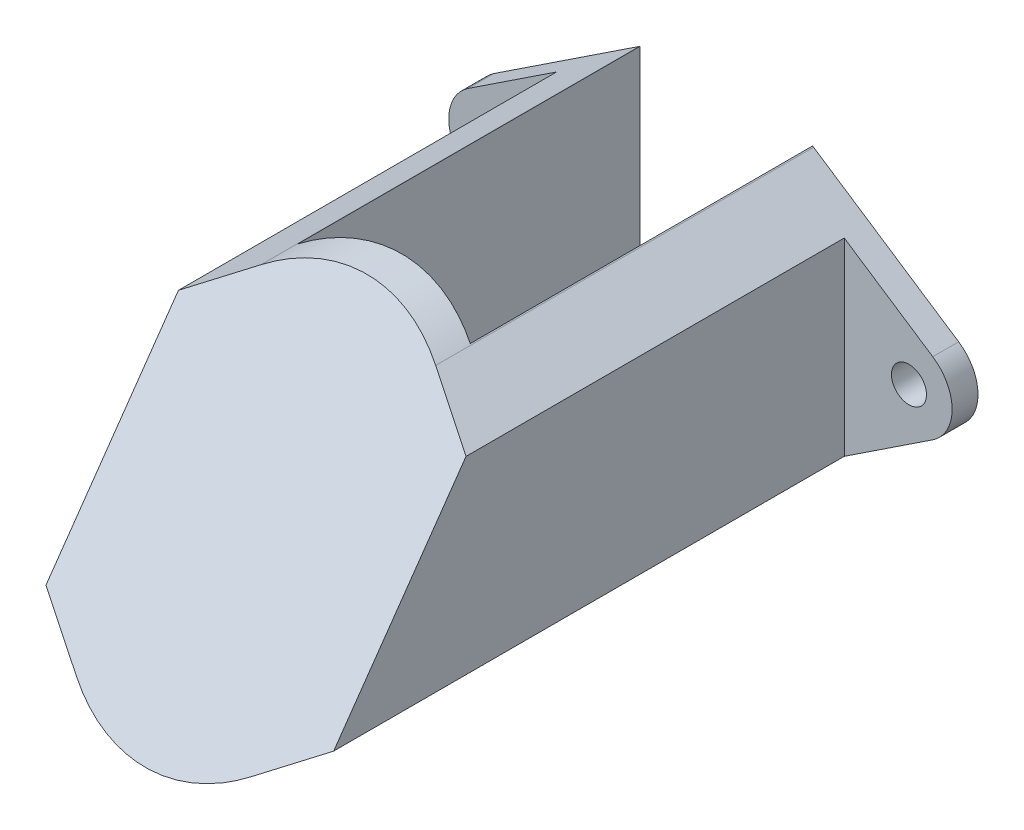
ISO-10303-21;
HEADER;
FILE_DESCRIPTION(('STEP AP214'),'2;1');
FILE_NAME('part.step','',(''),(''),'','','');
FILE_SCHEMA(('AUTOMOTIVE_DESIGN { 1 0 10303 214 1 1 1 1 }'));
ENDSEC;
DATA;
#1=APPLICATION_CONTEXT('core data for automotive mechanical design processes');
#2=APPLICATION_PROTOCOL_DEFINITION('international standard','automotive_design',2000,#1);
#3=PRODUCT_CONTEXT('',#1,'mechanical');
#4=PRODUCT('Part','Part','',(#3));
#5=PRODUCT_RELATED_PRODUCT_CATEGORY('part','',(#4));
#6=PRODUCT_DEFINITION_FORMATION('','',#4);
#7=PRODUCT_DEFINITION_CONTEXT('part definition',#1,'design');
#8=PRODUCT_DEFINITION('design','',#6,#7);
#9=PRODUCT_DEFINITION_SHAPE('','',#8);
#10=(LENGTH_UNIT() NAMED_UNIT(*) SI_UNIT(.MILLI.,.METRE.));
#11=(NAMED_UNIT(*) PLANE_ANGLE_UNIT() SI_UNIT($,.RADIAN.));
#12=(NAMED_UNIT(*) SI_UNIT($,.STERADIAN.) SOLID_ANGLE_UNIT());
#13=UNCERTAINTY_MEASURE_WITH_UNIT(LENGTH_MEASURE(1.E-05),#10,'distance_accuracy_value','');
#14=(GEOMETRIC_REPRESENTATION_CONTEXT(3) GLOBAL_UNCERTAINTY_ASSIGNED_CONTEXT((#13)) GLOBAL_UNIT_ASSIGNED_CONTEXT((#10,
#11,#12)) REPRESENTATION_CONTEXT('',''));
#15=CARTESIAN_POINT('',(0.,0.,0.));
#16=DIRECTION('',(0.,0.,1.));
#17=DIRECTION('',(1.,0.,0.));
#18=AXIS2_PLACEMENT_3D('',#15,#16,#17);
#19=CARTESIAN_POINT('',(-14.5,0.,0.));
#20=DIRECTION('',(0.,0.,1.));
#21=DIRECTION('',(1.,0.,0.));
#22=AXIS2_PLACEMENT_3D('',#19,#20,#21);
#23=PLANE('',#22);
#24=CARTESIAN_POINT('',(-14.5,0.,0.));
#25=DIRECTION('',(0.,0.,1.));
#26=DIRECTION('',(1.,0.,0.));
#27=AXIS2_PLACEMENT_3D('',#24,#25,#26);
#28=CIRCLE('',#27,1.2192);
#29=CARTESIAN_POINT('',(-13.2808,0.,0.));
#30=VERTEX_POINT('',#29);
#31=EDGE_CURVE('E183',#30,#30,#28,.T.);
#32=ORIENTED_EDGE('',*,*,#31,.T.);
#33=EDGE_LOOP('',(#32));
#34=FACE_BOUND('',#33,.T.);
#35=CARTESIAN_POINT('',(0.,0.,0.));
#36=DIRECTION('',(0.,0.,1.));
#37=DIRECTION('',(1.,0.,0.));
#38=AXIS2_PLACEMENT_3D('',#35,#36,#37);
#39=CIRCLE('',#38,11.);
#40=CARTESIAN_POINT('',(-6.00000000000001,9.21954445729288,0.));
#41=VERTEX_POINT('',#40);
#42=CARTESIAN_POINT('',(-6.06896551724138,9.174293299788,0.));
#43=VERTEX_POINT('',#42);
#44=EDGE_CURVE('E243',#41,#43,#39,.T.);
#45=ORIENTED_EDGE('',*,*,#44,.F.);
#46=DIRECTION('',(0.,-1.,0.));
#47=VECTOR('',#46,1.);
#48=CARTESIAN_POINT('',(-6.00000000000001,0.,0.));
#49=LINE('',#48,#47);
#50=CARTESIAN_POINT('',(-6.00000000000001,-9.21954445729288,0.));
#51=VERTEX_POINT('',#50);
#52=EDGE_CURVE('E44',#41,#51,#49,.T.);
#53=ORIENTED_EDGE('',*,*,#52,.T.);
#54=CARTESIAN_POINT('',(0.,0.,0.));
#55=DIRECTION('',(0.,0.,1.));
#56=DIRECTION('',(1.,0.,0.));
#57=AXIS2_PLACEMENT_3D('',#54,#55,#56);
#58=CIRCLE('',#57,11.);
#59=CARTESIAN_POINT('',(-6.06896551724137,-9.174293299788,0.));
#60=VERTEX_POINT('',#59);
#61=EDGE_CURVE('E232',#60,#51,#58,.T.);
#62=ORIENTED_EDGE('',*,*,#61,.F.);
#63=DIRECTION('',(0.834026663617092,-0.551724137931034,0.));
#64=VECTOR('',#63,1.);
#65=CARTESIAN_POINT('',(-6.06896551724137,-9.174293299788,0.));
#66=LINE('',#65,#64);
#67=CARTESIAN_POINT('',(-16.1551724137931,-2.50207999085127,0.));
#68=VERTEX_POINT('',#67);
#69=EDGE_CURVE('E228',#68,#60,#66,.T.);
#70=ORIENTED_EDGE('',*,*,#69,.F.);
#71=CARTESIAN_POINT('',(-14.5,0.,0.));
#72=DIRECTION('',(0.,0.,1.));
#73=DIRECTION('',(1.,0.,0.));
#74=AXIS2_PLACEMENT_3D('',#71,#72,#73);
#75=CIRCLE('',#74,3.);
#76=CARTESIAN_POINT('',(-16.1551724137931,2.50207999085127,0.));
#77=VERTEX_POINT('',#76);
#78=EDGE_CURVE('E225',#77,#68,#75,.T.);
#79=ORIENTED_EDGE('',*,*,#78,.F.);
#80=DIRECTION('',(-0.834026663617092,-0.551724137931034,0.));
#81=VECTOR('',#80,1.);
#82=CARTESIAN_POINT('',(-16.1551724137931,2.50207999085127,0.));
#83=LINE('',#82,#81);
#84=EDGE_CURVE('E247',#43,#77,#83,.T.);
#85=ORIENTED_EDGE('',*,*,#84,.F.);
#86=EDGE_LOOP('',(#45,#53,#62,#70,#79,#85));
#87=FACE_BOUND('',#86,.T.);
#88=ADVANCED_FACE('F36',(#34,#87),#23,.F.);
#89=CARTESIAN_POINT('',(-17.5,11.,25.));
#90=DIRECTION('',(0.,0.573576436351041,0.819152044288995));
#91=DIRECTION('',(0.,-0.819152044288995,0.573576436351041));
#92=AXIS2_PLACEMENT_3D('',#89,#90,#91);
#93=PLANE('',#92);
#94=DIRECTION('',(-0.777989561921298,-0.514654553739108,0.360364998102073));
#95=VECTOR('',#94,1.);
#96=CARTESIAN_POINT('',(-20.0941470695361,-0.10362494770183,32.7748418898341));
#97=LINE('',#96,#95);
#98=CARTESIAN_POINT('',(-6.06896551724137,9.174293299788,26.2783735940484));
#99=VERTEX_POINT('',#98);
#100=CARTESIAN_POINT('',(-10.,6.57384093322804,28.099229943869));
#101=VERTEX_POINT('',#100);
#102=EDGE_CURVE('E268',#99,#101,#97,.T.);
#103=ORIENTED_EDGE('',*,*,#102,.T.);
#104=DIRECTION('',(0.,-0.819152044288995,0.573576436351041));
#105=VECTOR('',#104,1.);
#106=CARTESIAN_POINT('',(-10.,11.,25.));
#107=LINE('',#106,#105);
#108=CARTESIAN_POINT('',(-10.,-6.57384093322804,37.3053358967445));
#109=VERTEX_POINT('',#108);
#110=EDGE_CURVE('E274',#101,#109,#107,.T.);
#111=ORIENTED_EDGE('',*,*,#110,.T.);
#112=DIRECTION('',(0.777989561921298,-0.514654553739107,0.360364998102073));
#113=VECTOR('',#112,1.);
#114=CARTESIAN_POINT('',(-4.4221835595796,-10.2636701693607,39.8889821425911));
#115=LINE('',#114,#113);
#116=CARTESIAN_POINT('',(-6.06896551724137,-9.174293299788,39.126192246565));
#117=VERTEX_POINT('',#116);
#118=EDGE_CURVE('E218',#109,#117,#115,.T.);
#119=ORIENTED_EDGE('',*,*,#118,.T.);
#120=CARTESIAN_POINT('',(0.,0.,32.7022829203067));
#121=DIRECTION('',(0.,0.573576436351041,0.819152044288995));
#122=DIRECTION('',(0.,0.819152044288995,-0.573576436351041));
#123=AXIS2_PLACEMENT_3D('',#120,#121,#122);
#124=ELLIPSE('',#123,13.428520476376,11.);
#125=CARTESIAN_POINT('',(6.06896551724138,-9.174293299788,39.126192246565));
#126=VERTEX_POINT('',#125);
#127=EDGE_CURVE('E223',#117,#126,#124,.T.);
#128=ORIENTED_EDGE('',*,*,#127,.T.);
#129=DIRECTION('',(0.777989561921297,0.514654553739108,-0.360364998102073));
#130=VECTOR('',#129,1.);
#131=CARTESIAN_POINT('',(13.1985660572277,-4.45793004269847,35.8237591410157));
#132=LINE('',#131,#130);
#133=CARTESIAN_POINT('',(9.99999999999999,-6.57384093322805,37.3053358967445));
#134=VERTEX_POINT('',#133);
#135=EDGE_CURVE('E220',#126,#134,#132,.T.);
#136=ORIENTED_EDGE('',*,*,#135,.T.);
#137=DIRECTION('',(0.,0.819152044288995,-0.573576436351041));
#138=VECTOR('',#137,1.);
#139=CARTESIAN_POINT('',(9.99999999999999,11.,25.));
#140=LINE('',#139,#138);
#141=CARTESIAN_POINT('',(9.99999999999999,6.57384093322805,28.099229943869));
#142=VERTEX_POINT('',#141);
#143=EDGE_CURVE('E271',#134,#142,#140,.T.);
#144=ORIENTED_EDGE('',*,*,#143,.T.);
#145=DIRECTION('',(-0.777989561921298,0.514654553739107,-0.360364998102073));
#146=VECTOR('',#145,1.);
#147=CARTESIAN_POINT('',(11.317764571888,5.70211517896037,28.7096188882587));
#148=LINE('',#147,#146);
#149=CARTESIAN_POINT('',(6.06896551724137,9.174293299788,26.2783735940484));
#150=VERTEX_POINT('',#149);
#151=EDGE_CURVE('E216',#142,#150,#148,.T.);
#152=ORIENTED_EDGE('',*,*,#151,.T.);
#153=CARTESIAN_POINT('',(0.,0.,32.7022829203067));
#154=DIRECTION('',(0.,0.573576436351041,0.819152044288995));
#155=DIRECTION('',(0.,0.819152044288995,-0.573576436351041));
#156=AXIS2_PLACEMENT_3D('',#153,#154,#155);
#157=ELLIPSE('',#156,13.428520476376,11.);
#158=EDGE_CURVE('E214',#150,#99,#157,.T.);
#159=ORIENTED_EDGE('',*,*,#158,.T.);
#160=EDGE_LOOP('',(#103,#111,#119,#128,#136,#144,#152,#159));
#161=FACE_BOUND('',#160,.T.);
#162=ADVANCED_FACE('F320',(#161),#93,.T.);
#163=CARTESIAN_POINT('',(-14.5,0.,45.));
#164=DIRECTION('',(0.,0.,-1.));
#165=DIRECTION('',(-1.,0.,0.));
#166=AXIS2_PLACEMENT_3D('',#163,#164,#165);
#167=CYLINDRICAL_SURFACE('',#166,3.);
#168=DIRECTION('',(0.,0.,-1.));
#169=VECTOR('',#168,1.);
#170=CARTESIAN_POINT('',(-16.1551724137931,-2.50207999085127,45.));
#171=LINE('',#170,#169);
#172=CARTESIAN_POINT('',(-16.1551724137931,-2.50207999085128,1.8));
#173=VERTEX_POINT('',#172);
#174=EDGE_CURVE('E266',#173,#68,#171,.T.);
#175=ORIENTED_EDGE('',*,*,#174,.F.);
#176=CARTESIAN_POINT('',(-14.5,0.,1.8));
#177=DIRECTION('',(0.,0.,-1.));
#178=DIRECTION('',(-1.,0.,0.));
#179=AXIS2_PLACEMENT_3D('',#176,#177,#178);
#180=CIRCLE('',#179,3.);
#181=CARTESIAN_POINT('',(-16.1551724137931,2.50207999085127,1.8));
#182=VERTEX_POINT('',#181);
#183=EDGE_CURVE('E199',#173,#182,#180,.T.);
#184=ORIENTED_EDGE('',*,*,#183,.T.);
#185=DIRECTION('',(0.,0.,-1.));
#186=VECTOR('',#185,1.);
#187=CARTESIAN_POINT('',(-16.1551724137931,2.50207999085127,45.));
#188=LINE('',#187,#186);
#189=EDGE_CURVE('E250',#182,#77,#188,.T.);
#190=ORIENTED_EDGE('',*,*,#189,.T.);
#191=ORIENTED_EDGE('',*,*,#78,.T.);
#192=EDGE_LOOP('',(#175,#184,#190,#191));
#193=FACE_BOUND('',#192,.T.);
#194=ADVANCED_FACE('F38',(#193),#167,.T.);
#195=CARTESIAN_POINT('',(-6.06896551724137,-9.174293299788,45.));
#196=DIRECTION('',(0.551724137931034,0.834026663617092,0.));
#197=DIRECTION('',(-0.834026663617092,0.551724137931034,0.));
#198=AXIS2_PLACEMENT_3D('',#195,#196,#197);
#199=PLANE('',#198);
#200=DIRECTION('',(0.,0.,1.));
#201=VECTOR('',#200,1.);
#202=CARTESIAN_POINT('',(-10.,-6.57384093322804,45.));
#203=LINE('',#202,#201);
#204=CARTESIAN_POINT('',(-10.,-6.57384093322804,1.8));
#205=VERTEX_POINT('',#204);
#206=EDGE_CURVE('E59',#205,#109,#203,.T.);
#207=ORIENTED_EDGE('',*,*,#206,.F.);
#208=DIRECTION('',(-0.834026663617092,0.551724137931034,0.));
#209=VECTOR('',#208,1.);
#210=CARTESIAN_POINT('',(-6.06896551724137,-9.174293299788,1.8));
#211=LINE('',#210,#209);
#212=EDGE_CURVE('E202',#205,#173,#211,.T.);
#213=ORIENTED_EDGE('',*,*,#212,.T.);
#214=ORIENTED_EDGE('',*,*,#174,.T.);
#215=ORIENTED_EDGE('',*,*,#69,.T.);
#216=DIRECTION('',(0.,0.,-1.));
#217=VECTOR('',#216,1.);
#218=CARTESIAN_POINT('',(-6.06896551724137,-9.174293299788,45.));
#219=LINE('',#218,#217);
#220=EDGE_CURVE('E264',#117,#60,#219,.T.);
#221=ORIENTED_EDGE('',*,*,#220,.F.);
#222=ORIENTED_EDGE('',*,*,#118,.F.);
#223=EDGE_LOOP('',(#207,#213,#214,#215,#221,#222));
#224=FACE_BOUND('',#223,.T.);
#225=ADVANCED_FACE('F292',(#224),#199,.F.);
#226=CARTESIAN_POINT('',(0.,0.,45.));
#227=DIRECTION('',(0.,0.,-1.));
#228=DIRECTION('',(-1.,0.,0.));
#229=AXIS2_PLACEMENT_3D('',#226,#227,#228);
#230=CYLINDRICAL_SURFACE('',#229,11.);
#231=ORIENTED_EDGE('',*,*,#61,.T.);
#232=DIRECTION('',(0.,0.,-1.));
#233=VECTOR('',#232,1.);
#234=CARTESIAN_POINT('',(-6.00000000000001,-9.21954445729288,45.));
#235=LINE('',#234,#233);
#236=CARTESIAN_POINT('',(-6.00000000000001,-9.21954445729285,36.7163282706398));
#237=VERTEX_POINT('',#236);
#238=EDGE_CURVE('E169',#51,#237,#235,.F.);
#239=ORIENTED_EDGE('',*,*,#238,.T.);
#240=CARTESIAN_POINT('',(0.,0.,30.2607337427839));
#241=DIRECTION('',(0.,-0.573576436351041,-0.819152044288995));
#242=DIRECTION('',(0.,0.819152044288995,-0.573576436351041));
#243=AXIS2_PLACEMENT_3D('',#240,#241,#242);
#244=ELLIPSE('',#243,13.428520476376,11.);
#245=CARTESIAN_POINT('',(6.00000000000001,-9.21954445729285,36.7163282706398));
#246=VERTEX_POINT('',#245);
#247=EDGE_CURVE('E161',#246,#237,#244,.T.);
#248=ORIENTED_EDGE('',*,*,#247,.F.);
#249=DIRECTION('',(0.,0.,-1.));
#250=VECTOR('',#249,1.);
#251=CARTESIAN_POINT('',(6.00000000000001,-9.21954445729287,45.));
#252=LINE('',#251,#250);
#253=CARTESIAN_POINT('',(6.00000000000001,-9.21954445729288,0.));
#254=VERTEX_POINT('',#253);
#255=EDGE_CURVE('E148',#246,#254,#252,.T.);
#256=ORIENTED_EDGE('',*,*,#255,.T.);
#257=CARTESIAN_POINT('',(6.06896551724138,-9.174293299788,0.));
#258=VERTEX_POINT('',#257);
#259=EDGE_CURVE('E231',#254,#258,#58,.T.);
#260=ORIENTED_EDGE('',*,*,#259,.T.);
#261=DIRECTION('',(0.,0.,-1.));
#262=VECTOR('',#261,1.);
#263=CARTESIAN_POINT('',(6.06896551724138,-9.174293299788,45.));
#264=LINE('',#263,#262);
#265=EDGE_CURVE('E261',#126,#258,#264,.T.);
#266=ORIENTED_EDGE('',*,*,#265,.F.);
#267=ORIENTED_EDGE('',*,*,#127,.F.);
#268=ORIENTED_EDGE('',*,*,#220,.T.);
#269=EDGE_LOOP('',(#231,#239,#248,#256,#260,#266,#267,#268));
#270=FACE_BOUND('',#269,.T.);
#271=ADVANCED_FACE('F168',(#270),#230,.T.);
#272=CARTESIAN_POINT('',(16.1551724137931,-2.50207999085127,45.));
#273=DIRECTION('',(-0.551724137931035,0.834026663617091,0.));
#274=DIRECTION('',(-0.834026663617091,-0.551724137931035,0.));
#275=AXIS2_PLACEMENT_3D('',#272,#273,#274);
#276=PLANE('',#275);
#277=DIRECTION('',(0.,0.,-1.));
#278=VECTOR('',#277,1.);
#279=CARTESIAN_POINT('',(16.1551724137931,-2.50207999085127,45.));
#280=LINE('',#279,#278);
#281=CARTESIAN_POINT('',(16.1551724137931,-2.50207999085127,1.8));
#282=VERTEX_POINT('',#281);
#283=CARTESIAN_POINT('',(16.1551724137931,-2.50207999085127,0.));
#284=VERTEX_POINT('',#283);
#285=EDGE_CURVE('E259',#282,#284,#280,.T.);
#286=ORIENTED_EDGE('',*,*,#285,.F.);
#287=DIRECTION('',(-0.834026663617091,-0.551724137931035,0.));
#288=VECTOR('',#287,1.);
#289=CARTESIAN_POINT('',(16.1551724137931,-2.50207999085127,1.8));
#290=LINE('',#289,#288);
#291=CARTESIAN_POINT('',(10.,-6.57384093322805,1.8));
#292=VERTEX_POINT('',#291);
#293=EDGE_CURVE('E211',#282,#292,#290,.T.);
#294=ORIENTED_EDGE('',*,*,#293,.T.);
#295=DIRECTION('',(0.,0.,-1.));
#296=VECTOR('',#295,1.);
#297=CARTESIAN_POINT('',(10.,-6.57384093322805,45.));
#298=LINE('',#297,#296);
#299=EDGE_CURVE('E194',#134,#292,#298,.T.);
#300=ORIENTED_EDGE('',*,*,#299,.F.);
#301=ORIENTED_EDGE('',*,*,#135,.F.);
#302=ORIENTED_EDGE('',*,*,#265,.T.);
#303=DIRECTION('',(0.834026663617091,0.551724137931035,0.));
#304=VECTOR('',#303,1.);
#305=CARTESIAN_POINT('',(16.1551724137931,-2.50207999085127,0.));
#306=LINE('',#305,#304);
#307=EDGE_CURVE('E234',#258,#284,#306,.T.);
#308=ORIENTED_EDGE('',*,*,#307,.T.);
#309=EDGE_LOOP('',(#286,#294,#300,#301,#302,#308));
#310=FACE_BOUND('',#309,.T.);
#311=ADVANCED_FACE('F348',(#310),#276,.F.);
#312=CARTESIAN_POINT('',(14.5,0.,45.));
#313=DIRECTION('',(0.,0.,-1.));
#314=DIRECTION('',(-1.,0.,0.));
#315=AXIS2_PLACEMENT_3D('',#312,#313,#314);
#316=CYLINDRICAL_SURFACE('',#315,3.);
#317=DIRECTION('',(0.,0.,-1.));
#318=VECTOR('',#317,1.);
#319=CARTESIAN_POINT('',(16.1551724137931,2.50207999085128,45.));
#320=LINE('',#319,#318);
#321=CARTESIAN_POINT('',(16.1551724137931,2.50207999085128,1.8));
#322=VERTEX_POINT('',#321);
#323=CARTESIAN_POINT('',(16.1551724137931,2.50207999085128,0.));
#324=VERTEX_POINT('',#323);
#325=EDGE_CURVE('E257',#322,#324,#320,.T.);
#326=ORIENTED_EDGE('',*,*,#325,.F.);
#327=CARTESIAN_POINT('',(14.5,0.,1.8));
#328=DIRECTION('',(0.,0.,-1.));
#329=DIRECTION('',(-1.,0.,0.));
#330=AXIS2_PLACEMENT_3D('',#327,#328,#329);
#331=CIRCLE('',#330,3.);
#332=EDGE_CURVE('E208',#322,#282,#331,.T.);
#333=ORIENTED_EDGE('',*,*,#332,.T.);
#334=ORIENTED_EDGE('',*,*,#285,.T.);
#335=CARTESIAN_POINT('',(14.5,0.,0.));
#336=DIRECTION('',(0.,0.,1.));
#337=DIRECTION('',(1.,0.,0.));
#338=AXIS2_PLACEMENT_3D('',#335,#336,#337);
#339=CIRCLE('',#338,3.);
#340=EDGE_CURVE('E237',#284,#324,#339,.T.);
#341=ORIENTED_EDGE('',*,*,#340,.T.);
#342=EDGE_LOOP('',(#326,#333,#334,#341));
#343=FACE_BOUND('',#342,.T.);
#344=ADVANCED_FACE('F360',(#343),#316,.T.);
#345=CARTESIAN_POINT('',(6.06896551724137,9.174293299788,45.));
#346=DIRECTION('',(-0.551724137931033,-0.834026663617092,0.));
#347=DIRECTION('',(0.834026663617092,-0.551724137931034,0.));
#348=AXIS2_PLACEMENT_3D('',#345,#346,#347);
#349=PLANE('',#348);
#350=DIRECTION('',(0.,0.,1.));
#351=VECTOR('',#350,1.);
#352=CARTESIAN_POINT('',(10.,6.57384093322805,45.));
#353=LINE('',#352,#351);
#354=CARTESIAN_POINT('',(10.,6.57384093322805,1.8));
#355=VERTEX_POINT('',#354);
#356=EDGE_CURVE('E192',#355,#142,#353,.T.);
#357=ORIENTED_EDGE('',*,*,#356,.F.);
#358=DIRECTION('',(0.834026663617092,-0.551724137931034,0.));
#359=VECTOR('',#358,1.);
#360=CARTESIAN_POINT('',(6.06896551724137,9.174293299788,1.8));
#361=LINE('',#360,#359);
#362=EDGE_CURVE('E205',#355,#322,#361,.T.);
#363=ORIENTED_EDGE('',*,*,#362,.T.);
#364=ORIENTED_EDGE('',*,*,#325,.T.);
#365=DIRECTION('',(-0.834026663617092,0.551724137931034,0.));
#366=VECTOR('',#365,1.);
#367=CARTESIAN_POINT('',(6.06896551724137,9.174293299788,0.));
#368=LINE('',#367,#366);
#369=CARTESIAN_POINT('',(6.06896551724137,9.174293299788,0.));
#370=VERTEX_POINT('',#369);
#371=EDGE_CURVE('E240',#324,#370,#368,.T.);
#372=ORIENTED_EDGE('',*,*,#371,.T.);
#373=DIRECTION('',(0.,0.,-1.));
#374=VECTOR('',#373,1.);
#375=CARTESIAN_POINT('',(6.06896551724137,9.174293299788,45.));
#376=LINE('',#375,#374);
#377=EDGE_CURVE('E255',#150,#370,#376,.T.);
#378=ORIENTED_EDGE('',*,*,#377,.F.);
#379=ORIENTED_EDGE('',*,*,#151,.F.);
#380=EDGE_LOOP('',(#357,#363,#364,#372,#378,#379));
#381=FACE_BOUND('',#380,.T.);
#382=ADVANCED_FACE('F356',(#381),#349,.F.);
#383=CARTESIAN_POINT('',(0.,0.,45.));
#384=DIRECTION('',(0.,0.,-1.));
#385=DIRECTION('',(-1.,0.,0.));
#386=AXIS2_PLACEMENT_3D('',#383,#384,#385);
#387=CYLINDRICAL_SURFACE('',#386,11.);
#388=CARTESIAN_POINT('',(0.,0.,30.2607337427839));
#389=DIRECTION('',(0.,-0.573576436351041,-0.819152044288995));
#390=DIRECTION('',(0.,0.819152044288995,-0.573576436351041));
#391=AXIS2_PLACEMENT_3D('',#388,#389,#390);
#392=ELLIPSE('',#391,13.428520476376,11.);
#393=CARTESIAN_POINT('',(-6.00000000000001,9.2195444572929,23.8051392149279));
#394=VERTEX_POINT('',#393);
#395=CARTESIAN_POINT('',(6.00000000000001,9.2195444572929,23.8051392149279));
#396=VERTEX_POINT('',#395);
#397=EDGE_CURVE('E12',#394,#396,#392,.T.);
#398=ORIENTED_EDGE('',*,*,#397,.F.);
#399=DIRECTION('',(0.,0.,-1.));
#400=VECTOR('',#399,1.);
#401=CARTESIAN_POINT('',(-6.00000000000001,9.21954445729287,45.));
#402=LINE('',#401,#400);
#403=EDGE_CURVE('E156',#394,#41,#402,.T.);
#404=ORIENTED_EDGE('',*,*,#403,.T.);
#405=ORIENTED_EDGE('',*,*,#44,.T.);
#406=DIRECTION('',(0.,0.,-1.));
#407=VECTOR('',#406,1.);
#408=CARTESIAN_POINT('',(-6.06896551724138,9.174293299788,45.));
#409=LINE('',#408,#407);
#410=EDGE_CURVE('E252',#99,#43,#409,.T.);
#411=ORIENTED_EDGE('',*,*,#410,.F.);
#412=ORIENTED_EDGE('',*,*,#158,.F.);
#413=ORIENTED_EDGE('',*,*,#377,.T.);
#414=CARTESIAN_POINT('',(6.00000000000001,9.21954445729287,0.));
#415=VERTEX_POINT('',#414);
#416=EDGE_CURVE('E244',#370,#415,#39,.T.);
#417=ORIENTED_EDGE('',*,*,#416,.T.);
#418=DIRECTION('',(0.,0.,-1.));
#419=VECTOR('',#418,1.);
#420=CARTESIAN_POINT('',(6.00000000000001,9.21954445729287,45.));
#421=LINE('',#420,#419);
#422=EDGE_CURVE('E51',#415,#396,#421,.F.);
#423=ORIENTED_EDGE('',*,*,#422,.T.);
#424=EDGE_LOOP('',(#398,#404,#405,#411,#412,#413,#417,#423));
#425=FACE_BOUND('',#424,.T.);
#426=ADVANCED_FACE('F304',(#425),#387,.T.);
#427=CARTESIAN_POINT('',(-16.1551724137931,2.50207999085127,45.));
#428=DIRECTION('',(0.551724137931034,-0.834026663617091,0.));
#429=DIRECTION('',(0.834026663617092,0.551724137931034,0.));
#430=AXIS2_PLACEMENT_3D('',#427,#428,#429);
#431=PLANE('',#430);
#432=ORIENTED_EDGE('',*,*,#189,.F.);
#433=DIRECTION('',(0.834026663617092,0.551724137931034,0.));
#434=VECTOR('',#433,1.);
#435=CARTESIAN_POINT('',(-16.1551724137931,2.50207999085127,1.8));
#436=LINE('',#435,#434);
#437=CARTESIAN_POINT('',(-10.,6.57384093322804,1.8));
#438=VERTEX_POINT('',#437);
#439=EDGE_CURVE('E276',#182,#438,#436,.T.);
#440=ORIENTED_EDGE('',*,*,#439,.T.);
#441=DIRECTION('',(0.,0.,-1.));
#442=VECTOR('',#441,1.);
#443=CARTESIAN_POINT('',(-10.,6.57384093322804,45.));
#444=LINE('',#443,#442);
#445=EDGE_CURVE('E196',#101,#438,#444,.T.);
#446=ORIENTED_EDGE('',*,*,#445,.F.);
#447=ORIENTED_EDGE('',*,*,#102,.F.);
#448=ORIENTED_EDGE('',*,*,#410,.T.);
#449=ORIENTED_EDGE('',*,*,#84,.T.);
#450=EDGE_LOOP('',(#432,#440,#446,#447,#448,#449));
#451=FACE_BOUND('',#450,.T.);
#452=ADVANCED_FACE('F298',(#451),#431,.F.);
#453=CARTESIAN_POINT('',(14.5,0.,0.));
#454=DIRECTION('',(0.,0.,1.));
#455=DIRECTION('',(1.,0.,0.));
#456=AXIS2_PLACEMENT_3D('',#453,#454,#455);
#457=CIRCLE('',#456,1.2192);
#458=CARTESIAN_POINT('',(15.7192,0.,0.));
#459=VERTEX_POINT('',#458);
#460=EDGE_CURVE('E173',#459,#459,#457,.T.);
#461=ORIENTED_EDGE('',*,*,#460,.T.);
#462=EDGE_LOOP('',(#461));
#463=FACE_BOUND('',#462,.T.);
#464=ORIENTED_EDGE('',*,*,#259,.F.);
#465=DIRECTION('',(0.,1.,0.));
#466=VECTOR('',#465,1.);
#467=CARTESIAN_POINT('',(6.00000000000001,0.,0.));
#468=LINE('',#467,#466);
#469=EDGE_CURVE('E152',#254,#415,#468,.T.);
#470=ORIENTED_EDGE('',*,*,#469,.T.);
#471=ORIENTED_EDGE('',*,*,#416,.F.);
#472=ORIENTED_EDGE('',*,*,#371,.F.);
#473=ORIENTED_EDGE('',*,*,#340,.F.);
#474=ORIENTED_EDGE('',*,*,#307,.F.);
#475=EDGE_LOOP('',(#464,#470,#471,#472,#473,#474));
#476=FACE_BOUND('',#475,.T.);
#477=ADVANCED_FACE('F323',(#463,#476),#23,.F.);
#478=CARTESIAN_POINT('',(10.,-12.2070171111801,40.4045658406135));
#479=DIRECTION('',(1.,0.,0.));
#480=DIRECTION('',(0.,0.,-1.));
#481=AXIS2_PLACEMENT_3D('',#478,#479,#480);
#482=PLANE('',#481);
#483=ORIENTED_EDGE('',*,*,#299,.T.);
#484=DIRECTION('',(0.,-1.,0.));
#485=VECTOR('',#484,1.);
#486=CARTESIAN_POINT('',(10.,-12.2070171111801,1.8));
#487=LINE('',#486,#485);
#488=EDGE_CURVE('E189',#355,#292,#487,.T.);
#489=ORIENTED_EDGE('',*,*,#488,.F.);
#490=ORIENTED_EDGE('',*,*,#356,.T.);
#491=ORIENTED_EDGE('',*,*,#143,.F.);
#492=EDGE_LOOP('',(#483,#489,#490,#491));
#493=FACE_BOUND('',#492,.T.);
#494=ADVANCED_FACE('F331',(#493),#482,.T.);
#495=CARTESIAN_POINT('',(0.,0.,1.8));
#496=DIRECTION('',(0.,0.,-1.));
#497=DIRECTION('',(-1.,0.,0.));
#498=AXIS2_PLACEMENT_3D('',#495,#496,#497);
#499=PLANE('',#498);
#500=CARTESIAN_POINT('',(14.5,0.,1.8));
#501=DIRECTION('',(0.,0.,1.));
#502=DIRECTION('',(1.,0.,0.));
#503=AXIS2_PLACEMENT_3D('',#500,#501,#502);
#504=CIRCLE('',#503,1.2192);
#505=CARTESIAN_POINT('',(15.7192,0.,1.8));
#506=VERTEX_POINT('',#505);
#507=EDGE_CURVE('E170',#506,#506,#504,.T.);
#508=ORIENTED_EDGE('',*,*,#507,.F.);
#509=EDGE_LOOP('',(#508));
#510=FACE_BOUND('',#509,.T.);
#511=ORIENTED_EDGE('',*,*,#332,.F.);
#512=ORIENTED_EDGE('',*,*,#362,.F.);
#513=ORIENTED_EDGE('',*,*,#488,.T.);
#514=ORIENTED_EDGE('',*,*,#293,.F.);
#515=EDGE_LOOP('',(#511,#512,#513,#514));
#516=FACE_BOUND('',#515,.T.);
#517=ADVANCED_FACE('F337',(#510,#516),#499,.F.);
#518=CARTESIAN_POINT('',(-14.5,0.,1.8));
#519=DIRECTION('',(0.,0.,1.));
#520=DIRECTION('',(1.,0.,0.));
#521=AXIS2_PLACEMENT_3D('',#518,#519,#520);
#522=CIRCLE('',#521,1.2192);
#523=CARTESIAN_POINT('',(-13.2808,0.,1.8));
#524=VERTEX_POINT('',#523);
#525=EDGE_CURVE('E180',#524,#524,#522,.T.);
#526=ORIENTED_EDGE('',*,*,#525,.F.);
#527=EDGE_LOOP('',(#526));
#528=FACE_BOUND('',#527,.T.);
#529=DIRECTION('',(0.,1.,0.));
#530=VECTOR('',#529,1.);
#531=CARTESIAN_POINT('',(-10.,-12.2070171111801,1.8));
#532=LINE('',#531,#530);
#533=EDGE_CURVE('E186',#205,#438,#532,.T.);
#534=ORIENTED_EDGE('',*,*,#533,.T.);
#535=ORIENTED_EDGE('',*,*,#439,.F.);
#536=ORIENTED_EDGE('',*,*,#183,.F.);
#537=ORIENTED_EDGE('',*,*,#212,.F.);
#538=EDGE_LOOP('',(#534,#535,#536,#537));
#539=FACE_BOUND('',#538,.T.);
#540=ADVANCED_FACE('F352',(#528,#539),#499,.F.);
#541=CARTESIAN_POINT('',(-10.,-12.2070171111801,40.4045658406135));
#542=DIRECTION('',(-1.,0.,0.));
#543=DIRECTION('',(0.,0.,1.));
#544=AXIS2_PLACEMENT_3D('',#541,#542,#543);
#545=PLANE('',#544);
#546=ORIENTED_EDGE('',*,*,#206,.T.);
#547=ORIENTED_EDGE('',*,*,#110,.F.);
#548=ORIENTED_EDGE('',*,*,#445,.T.);
#549=ORIENTED_EDGE('',*,*,#533,.F.);
#550=EDGE_LOOP('',(#546,#547,#548,#549));
#551=FACE_BOUND('',#550,.T.);
#552=ADVANCED_FACE('F353',(#551),#545,.T.);
#553=CARTESIAN_POINT('',(-14.5,0.,1.8));
#554=DIRECTION('',(0.,0.,1.));
#555=DIRECTION('',(1.,0.,0.));
#556=AXIS2_PLACEMENT_3D('',#553,#554,#555);
#557=CYLINDRICAL_SURFACE('',#556,1.2192);
#558=ORIENTED_EDGE('',*,*,#31,.F.);
#559=EDGE_LOOP('',(#558));
#560=FACE_BOUND('',#559,.T.);
#561=ORIENTED_EDGE('',*,*,#525,.T.);
#562=EDGE_LOOP('',(#561));
#563=FACE_BOUND('',#562,.T.);
#564=ADVANCED_FACE('F373',(#560,#563),#557,.F.);
#565=CARTESIAN_POINT('',(14.5,0.,1.8));
#566=DIRECTION('',(0.,0.,1.));
#567=DIRECTION('',(1.,0.,0.));
#568=AXIS2_PLACEMENT_3D('',#565,#566,#567);
#569=CYLINDRICAL_SURFACE('',#568,1.2192);
#570=ORIENTED_EDGE('',*,*,#460,.F.);
#571=EDGE_LOOP('',(#570));
#572=FACE_BOUND('',#571,.T.);
#573=ORIENTED_EDGE('',*,*,#507,.T.);
#574=EDGE_LOOP('',(#573));
#575=FACE_BOUND('',#574,.T.);
#576=ADVANCED_FACE('F316',(#572,#575),#569,.F.);
#577=CARTESIAN_POINT('',(0.,14.2178940988305,20.3052571173155));
#578=DIRECTION('',(0.,-0.573576436351041,-0.819152044288995));
#579=DIRECTION('',(0.,0.819152044288995,-0.573576436351041));
#580=AXIS2_PLACEMENT_3D('',#577,#578,#579);
#581=PLANE('',#580);
#582=ORIENTED_EDGE('',*,*,#247,.T.);
#583=DIRECTION('',(0.,-0.819152044288995,0.573576436351041));
#584=VECTOR('',#583,1.);
#585=CARTESIAN_POINT('',(-6.00000000000001,40.5829410703631,1.84425248259553));
#586=LINE('',#585,#584);
#587=EDGE_CURVE('E164',#394,#237,#586,.T.);
#588=ORIENTED_EDGE('',*,*,#587,.F.);
#589=ORIENTED_EDGE('',*,*,#397,.T.);
#590=DIRECTION('',(0.,0.819152044288995,-0.573576436351041));
#591=VECTOR('',#590,1.);
#592=CARTESIAN_POINT('',(6.00000000000001,40.5829410703631,1.84425248259553));
#593=LINE('',#592,#591);
#594=EDGE_CURVE('E151',#246,#396,#593,.T.);
#595=ORIENTED_EDGE('',*,*,#594,.F.);
#596=EDGE_LOOP('',(#582,#588,#589,#595));
#597=FACE_BOUND('',#596,.T.);
#598=ADVANCED_FACE('F159',(#597),#581,.T.);
#599=CARTESIAN_POINT('',(-6.00000000000001,22.7461577598238,-23.6293140490424));
#600=DIRECTION('',(-1.,0.,0.));
#601=DIRECTION('',(0.,0.,1.));
#602=AXIS2_PLACEMENT_3D('',#599,#600,#601);
#603=PLANE('',#602);
#604=ORIENTED_EDGE('',*,*,#52,.F.);
#605=ORIENTED_EDGE('',*,*,#403,.F.);
#606=ORIENTED_EDGE('',*,*,#587,.T.);
#607=ORIENTED_EDGE('',*,*,#238,.F.);
#608=EDGE_LOOP('',(#604,#605,#606,#607));
#609=FACE_BOUND('',#608,.T.);
#610=ADVANCED_FACE('F308',(#609),#603,.F.);
#611=CARTESIAN_POINT('',(6.00000000000001,22.7461577598238,-23.6293140490424));
#612=DIRECTION('',(1.,0.,0.));
#613=DIRECTION('',(0.,0.,-1.));
#614=AXIS2_PLACEMENT_3D('',#611,#612,#613);
#615=PLANE('',#614);
#616=ORIENTED_EDGE('',*,*,#594,.T.);
#617=ORIENTED_EDGE('',*,*,#422,.F.);
#618=ORIENTED_EDGE('',*,*,#469,.F.);
#619=ORIENTED_EDGE('',*,*,#255,.F.);
#620=EDGE_LOOP('',(#616,#617,#618,#619));
#621=FACE_BOUND('',#620,.T.);
#622=ADVANCED_FACE('F150',(#621),#615,.F.);
#623=CLOSED_SHELL('',(#88,#162,#194,#225,#271,#311,#344,#382,#426,#452,#477,#494,#517,#540,#552,
#564,#576,#598,#610,#622));
#624=MANIFOLD_SOLID_BREP('B2',#623);
#625=ADVANCED_BREP_SHAPE_REPRESENTATION('',(#18,#624),#14);
#626=SHAPE_DEFINITION_REPRESENTATION(#9,#625);
ENDSEC;
END-ISO-10303-21;
